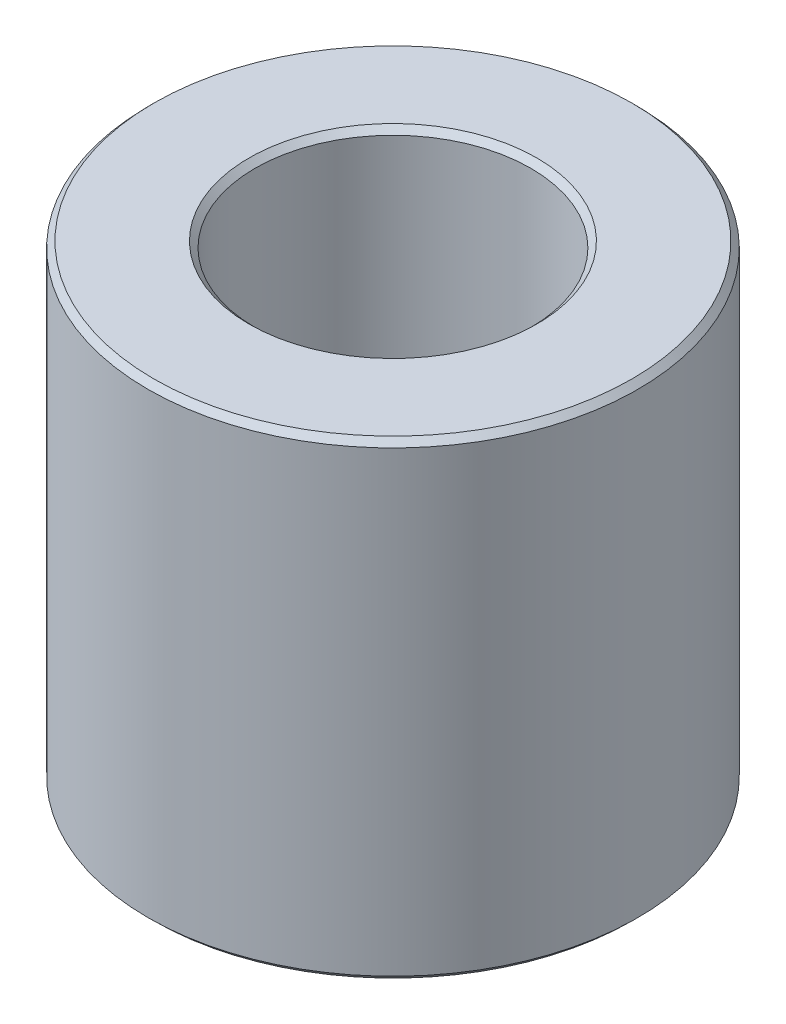
ISO-10303-21;
HEADER;
FILE_DESCRIPTION(('STEP AP214'),'2;1');
FILE_NAME('part.step','',(''),(''),'','','');
FILE_SCHEMA(('AUTOMOTIVE_DESIGN { 1 0 10303 214 1 1 1 1 }'));
ENDSEC;
DATA;
#1=APPLICATION_CONTEXT('core data for automotive mechanical design processes');
#2=APPLICATION_PROTOCOL_DEFINITION('international standard','automotive_design',2000,#1);
#3=PRODUCT_CONTEXT('',#1,'mechanical');
#4=PRODUCT('Part','Part','',(#3));
#5=PRODUCT_RELATED_PRODUCT_CATEGORY('part','',(#4));
#6=PRODUCT_DEFINITION_FORMATION('','',#4);
#7=PRODUCT_DEFINITION_CONTEXT('part definition',#1,'design');
#8=PRODUCT_DEFINITION('design','',#6,#7);
#9=PRODUCT_DEFINITION_SHAPE('','',#8);
#10=(LENGTH_UNIT() NAMED_UNIT(*) SI_UNIT(.MILLI.,.METRE.));
#11=(NAMED_UNIT(*) PLANE_ANGLE_UNIT() SI_UNIT($,.RADIAN.));
#12=(NAMED_UNIT(*) SI_UNIT($,.STERADIAN.) SOLID_ANGLE_UNIT());
#13=UNCERTAINTY_MEASURE_WITH_UNIT(LENGTH_MEASURE(1.E-05),#10,'distance_accuracy_value','');
#14=(GEOMETRIC_REPRESENTATION_CONTEXT(3) GLOBAL_UNCERTAINTY_ASSIGNED_CONTEXT((#13)) GLOBAL_UNIT_ASSIGNED_CONTEXT((#10,
#11,#12)) REPRESENTATION_CONTEXT('',''));
#15=CARTESIAN_POINT('',(0.,0.,0.));
#16=DIRECTION('',(0.,0.,1.));
#17=DIRECTION('',(1.,0.,0.));
#18=AXIS2_PLACEMENT_3D('',#15,#16,#17);
#19=CARTESIAN_POINT('',(0.,95.847833496901,0.));
#20=DIRECTION('',(0.,-1.,0.));
#21=DIRECTION('',(0.,0.,-1.));
#22=AXIS2_PLACEMENT_3D('',#19,#20,#21);
#23=CYLINDRICAL_SURFACE('',#22,50.);
#24=CARTESIAN_POINT('',(0.,1.20475639219375,0.));
#25=DIRECTION('',(0.,1.,0.));
#26=DIRECTION('',(0.,0.,1.));
#27=AXIS2_PLACEMENT_3D('',#24,#25,#26);
#28=CIRCLE('',#27,50.);
#29=CARTESIAN_POINT('',(0.,1.20475639219375,50.));
#30=VERTEX_POINT('',#29);
#31=EDGE_CURVE('E10',#30,#30,#28,.T.);
#32=ORIENTED_EDGE('',*,*,#31,.T.);
#33=EDGE_LOOP('',(#32));
#34=FACE_BOUND('',#33,.T.);
#35=CARTESIAN_POINT('',(0.,94.6130960991658,0.));
#36=DIRECTION('',(0.,1.,0.));
#37=DIRECTION('',(0.,0.,1.));
#38=AXIS2_PLACEMENT_3D('',#35,#36,#37);
#39=CIRCLE('',#38,50.);
#40=CARTESIAN_POINT('',(0.,94.6130960991658,50.));
#41=VERTEX_POINT('',#40);
#42=EDGE_CURVE('E50',#41,#41,#39,.F.);
#43=ORIENTED_EDGE('',*,*,#42,.T.);
#44=EDGE_LOOP('',(#43));
#45=FACE_BOUND('',#44,.T.);
#46=ADVANCED_FACE('F39',(#34,#45),#23,.T.);
#47=CARTESIAN_POINT('',(0.,95.847833496901,0.));
#48=DIRECTION('',(0.,1.,0.));
#49=DIRECTION('',(0.,0.,1.));
#50=AXIS2_PLACEMENT_3D('',#47,#48,#49);
#51=PLANE('',#50);
#52=CARTESIAN_POINT('',(0.,95.847833496901,0.));
#53=DIRECTION('',(0.,1.,0.));
#54=DIRECTION('',(0.,0.,1.));
#55=AXIS2_PLACEMENT_3D('',#52,#53,#54);
#56=CIRCLE('',#55,29.3832413990154);
#57=CARTESIAN_POINT('',(0.,95.847833496901,29.3832413990154));
#58=VERTEX_POINT('',#57);
#59=EDGE_CURVE('E58',#58,#58,#56,.F.);
#60=ORIENTED_EDGE('',*,*,#59,.T.);
#61=EDGE_LOOP('',(#60));
#62=FACE_BOUND('',#61,.T.);
#63=CARTESIAN_POINT('',(0.,95.847833496901,0.));
#64=DIRECTION('',(0.,1.,0.));
#65=DIRECTION('',(0.,0.,1.));
#66=AXIS2_PLACEMENT_3D('',#63,#64,#65);
#67=CIRCLE('',#66,48.7952436078062);
#68=CARTESIAN_POINT('',(0.,95.847833496901,48.7952436078062));
#69=VERTEX_POINT('',#68);
#70=EDGE_CURVE('E61',#69,#69,#67,.T.);
#71=ORIENTED_EDGE('',*,*,#70,.T.);
#72=EDGE_LOOP('',(#71));
#73=FACE_BOUND('',#72,.T.);
#74=ADVANCED_FACE('F88',(#62,#73),#51,.T.);
#75=CARTESIAN_POINT('',(0.,0.,0.));
#76=DIRECTION('',(0.,1.,0.));
#77=DIRECTION('',(0.,0.,1.));
#78=AXIS2_PLACEMENT_3D('',#75,#76,#77);
#79=PLANE('',#78);
#80=CARTESIAN_POINT('',(0.,0.,0.));
#81=DIRECTION('',(0.,1.,0.));
#82=DIRECTION('',(0.,0.,1.));
#83=AXIS2_PLACEMENT_3D('',#80,#81,#82);
#84=CIRCLE('',#83,29.353260393474);
#85=CARTESIAN_POINT('',(0.,0.,29.353260393474));
#86=VERTEX_POINT('',#85);
#87=EDGE_CURVE('E51',#86,#86,#84,.T.);
#88=ORIENTED_EDGE('',*,*,#87,.T.);
#89=EDGE_LOOP('',(#88));
#90=FACE_BOUND('',#89,.T.);
#91=CARTESIAN_POINT('',(0.,0.,0.));
#92=DIRECTION('',(0.,1.,0.));
#93=DIRECTION('',(0.,0.,1.));
#94=AXIS2_PLACEMENT_3D('',#91,#92,#93);
#95=CIRCLE('',#94,48.7652626022648);
#96=CARTESIAN_POINT('',(0.,0.,48.7652626022648));
#97=VERTEX_POINT('',#96);
#98=EDGE_CURVE('E54',#97,#97,#95,.F.);
#99=ORIENTED_EDGE('',*,*,#98,.T.);
#100=EDGE_LOOP('',(#99));
#101=FACE_BOUND('',#100,.T.);
#102=ADVANCED_FACE('F83',(#90,#101),#79,.F.);
#103=CARTESIAN_POINT('',(0.,95.847833496901,0.));
#104=DIRECTION('',(0.,-1.,0.));
#105=DIRECTION('',(0.,0.,-1.));
#106=AXIS2_PLACEMENT_3D('',#103,#104,#105);
#107=CYLINDRICAL_SURFACE('',#106,28.1485040012802);
#108=CARTESIAN_POINT('',(0.,94.6430771047073,0.));
#109=DIRECTION('',(0.,1.,0.));
#110=DIRECTION('',(0.,0.,1.));
#111=AXIS2_PLACEMENT_3D('',#108,#109,#110);
#112=CIRCLE('',#111,28.1485040012802);
#113=CARTESIAN_POINT('',(0.,94.6430771047073,28.1485040012802));
#114=VERTEX_POINT('',#113);
#115=EDGE_CURVE('E67',#114,#114,#112,.T.);
#116=ORIENTED_EDGE('',*,*,#115,.T.);
#117=EDGE_LOOP('',(#116));
#118=FACE_BOUND('',#117,.T.);
#119=CARTESIAN_POINT('',(0.,1.23473739773523,0.));
#120=DIRECTION('',(0.,1.,0.));
#121=DIRECTION('',(0.,0.,1.));
#122=AXIS2_PLACEMENT_3D('',#119,#120,#121);
#123=CIRCLE('',#122,28.1485040012802);
#124=CARTESIAN_POINT('',(0.,1.23473739773523,28.1485040012802));
#125=VERTEX_POINT('',#124);
#126=EDGE_CURVE('E69',#125,#125,#123,.F.);
#127=ORIENTED_EDGE('',*,*,#126,.T.);
#128=EDGE_LOOP('',(#127));
#129=FACE_BOUND('',#128,.T.);
#130=ADVANCED_FACE('F71',(#118,#129),#107,.F.);
#131=CARTESIAN_POINT('',(0.,94.6430771047073,0.));
#132=DIRECTION('',(0.,1.,0.));
#133=DIRECTION('',(0.,0.,1.));
#134=AXIS2_PLACEMENT_3D('',#131,#132,#133);
#135=CONICAL_SURFACE('',#134,28.1485040012802,0.797687391742652);
#136=ORIENTED_EDGE('',*,*,#59,.F.);
#137=EDGE_LOOP('',(#136));
#138=FACE_BOUND('',#137,.T.);
#139=ORIENTED_EDGE('',*,*,#115,.F.);
#140=EDGE_LOOP('',(#139));
#141=FACE_BOUND('',#140,.T.);
#142=ADVANCED_FACE('F77',(#138,#141),#135,.F.);
#143=CARTESIAN_POINT('',(0.,0.,0.));
#144=DIRECTION('',(0.,-1.,0.));
#145=DIRECTION('',(0.,0.,-1.));
#146=AXIS2_PLACEMENT_3D('',#143,#144,#145);
#147=CONICAL_SURFACE('',#146,29.353260393474,0.773108935052238);
#148=ORIENTED_EDGE('',*,*,#126,.F.);
#149=EDGE_LOOP('',(#148));
#150=FACE_BOUND('',#149,.T.);
#151=ORIENTED_EDGE('',*,*,#87,.F.);
#152=EDGE_LOOP('',(#151));
#153=FACE_BOUND('',#152,.T.);
#154=ADVANCED_FACE('F73',(#150,#153),#147,.F.);
#155=CARTESIAN_POINT('',(0.,1.20475639219375,0.));
#156=DIRECTION('',(0.,1.,0.));
#157=DIRECTION('',(0.,0.,1.));
#158=AXIS2_PLACEMENT_3D('',#155,#156,#157);
#159=CONICAL_SURFACE('',#158,50.,0.797687391742667);
#160=ORIENTED_EDGE('',*,*,#98,.F.);
#161=EDGE_LOOP('',(#160));
#162=FACE_BOUND('',#161,.T.);
#163=ORIENTED_EDGE('',*,*,#31,.F.);
#164=EDGE_LOOP('',(#163));
#165=FACE_BOUND('',#164,.T.);
#166=ADVANCED_FACE('F76',(#162,#165),#159,.T.);
#167=CARTESIAN_POINT('',(0.,95.847833496901,0.));
#168=DIRECTION('',(0.,-1.,0.));
#169=DIRECTION('',(0.,0.,-1.));
#170=AXIS2_PLACEMENT_3D('',#167,#168,#169);
#171=CONICAL_SURFACE('',#170,48.7952436078062,0.773108935052235);
#172=ORIENTED_EDGE('',*,*,#42,.F.);
#173=EDGE_LOOP('',(#172));
#174=FACE_BOUND('',#173,.T.);
#175=ORIENTED_EDGE('',*,*,#70,.F.);
#176=EDGE_LOOP('',(#175));
#177=FACE_BOUND('',#176,.T.);
#178=ADVANCED_FACE('F45',(#174,#177),#171,.T.);
#179=CLOSED_SHELL('',(#46,#74,#102,#130,#142,#154,#166,#178));
#180=MANIFOLD_SOLID_BREP('B2',#179);
#181=ADVANCED_BREP_SHAPE_REPRESENTATION('',(#18,#180),#14);
#182=SHAPE_DEFINITION_REPRESENTATION(#9,#181);
ENDSEC;
END-ISO-10303-21;
